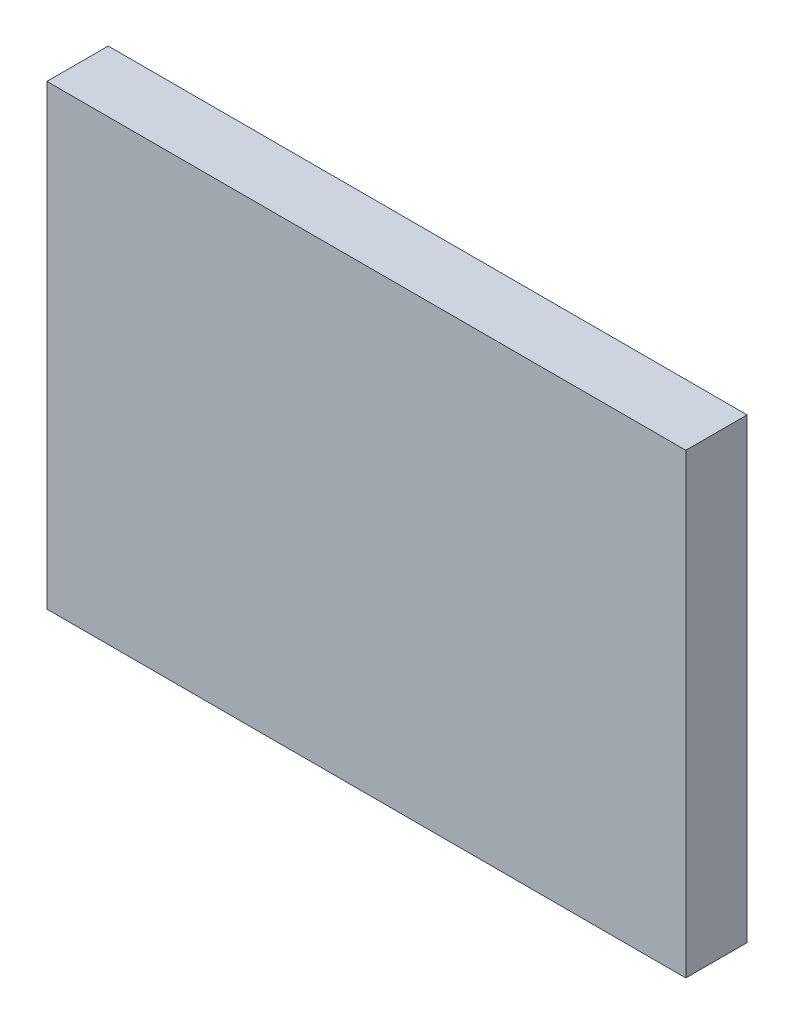
ISO-10303-21;
HEADER;
FILE_DESCRIPTION(('STEP AP214'),'2;1');
FILE_NAME('part.step','',(''),(''),'','','');
FILE_SCHEMA(('AUTOMOTIVE_DESIGN { 1 0 10303 214 1 1 1 1 }'));
ENDSEC;
DATA;
#1=APPLICATION_CONTEXT('core data for automotive mechanical design processes');
#2=APPLICATION_PROTOCOL_DEFINITION('international standard','automotive_design',2000,#1);
#3=PRODUCT_CONTEXT('',#1,'mechanical');
#4=PRODUCT('Part','Part','',(#3));
#5=PRODUCT_RELATED_PRODUCT_CATEGORY('part','',(#4));
#6=PRODUCT_DEFINITION_FORMATION('','',#4);
#7=PRODUCT_DEFINITION_CONTEXT('part definition',#1,'design');
#8=PRODUCT_DEFINITION('design','',#6,#7);
#9=PRODUCT_DEFINITION_SHAPE('','',#8);
#10=(LENGTH_UNIT() NAMED_UNIT(*) SI_UNIT(.MILLI.,.METRE.));
#11=(NAMED_UNIT(*) PLANE_ANGLE_UNIT() SI_UNIT($,.RADIAN.));
#12=(NAMED_UNIT(*) SI_UNIT($,.STERADIAN.) SOLID_ANGLE_UNIT());
#13=UNCERTAINTY_MEASURE_WITH_UNIT(LENGTH_MEASURE(1.E-05),#10,'distance_accuracy_value','');
#14=(GEOMETRIC_REPRESENTATION_CONTEXT(3) GLOBAL_UNCERTAINTY_ASSIGNED_CONTEXT((#13)) GLOBAL_UNIT_ASSIGNED_CONTEXT((#10,
#11,#12)) REPRESENTATION_CONTEXT('',''));
#15=CARTESIAN_POINT('',(0.,0.,0.));
#16=DIRECTION('',(0.,0.,1.));
#17=DIRECTION('',(1.,0.,0.));
#18=AXIS2_PLACEMENT_3D('',#15,#16,#17);
#19=CARTESIAN_POINT('',(0.49250811985747,-0.604008281971269,0.));
#20=DIRECTION('',(-1.,0.,0.));
#21=DIRECTION('',(0.,-1.,0.));
#22=AXIS2_PLACEMENT_3D('',#19,#20,#21);
#23=PLANE('',#22);
#24=DIRECTION('',(0.,-1.,0.));
#25=VECTOR('',#24,1.);
#26=CARTESIAN_POINT('',(0.49250811985747,-0.604008281971269,0.));
#27=LINE('',#26,#25);
#28=CARTESIAN_POINT('',(0.49250811985747,-0.604008281971269,0.));
#29=VERTEX_POINT('',#28);
#30=CARTESIAN_POINT('',(0.49250811985747,-0.626373786984169,0.));
#31=VERTEX_POINT('',#30);
#32=EDGE_CURVE('E11',#29,#31,#27,.T.);
#33=ORIENTED_EDGE('',*,*,#32,.T.);
#34=DIRECTION('',(0.,0.,1.));
#35=VECTOR('',#34,1.);
#36=CARTESIAN_POINT('',(0.49250811985747,-0.626373786984169,0.));
#37=LINE('',#36,#35);
#38=CARTESIAN_POINT('',(0.49250811985747,-0.626373786984169,0.003));
#39=VERTEX_POINT('',#38);
#40=EDGE_CURVE('E24',#31,#39,#37,.T.);
#41=ORIENTED_EDGE('',*,*,#40,.T.);
#42=DIRECTION('',(0.,-1.,0.));
#43=VECTOR('',#42,1.);
#44=CARTESIAN_POINT('',(0.49250811985747,-0.604008281971269,0.003));
#45=LINE('',#44,#43);
#46=CARTESIAN_POINT('',(0.49250811985747,-0.604008281971269,0.003));
#47=VERTEX_POINT('',#46);
#48=EDGE_CURVE('E75',#47,#39,#45,.T.);
#49=ORIENTED_EDGE('',*,*,#48,.F.);
#50=DIRECTION('',(0.,0.,1.));
#51=VECTOR('',#50,1.);
#52=CARTESIAN_POINT('',(0.49250811985747,-0.604008281971269,0.));
#53=LINE('',#52,#51);
#54=EDGE_CURVE('E86',#29,#47,#53,.T.);
#55=ORIENTED_EDGE('',*,*,#54,.F.);
#56=EDGE_LOOP('',(#33,#41,#49,#55));
#57=FACE_BOUND('',#56,.T.);
#58=ADVANCED_FACE('F17',(#57),#23,.T.);
#59=CARTESIAN_POINT('',(0.52377418298775,-0.604008281971269,0.));
#60=DIRECTION('',(0.,1.,0.));
#61=DIRECTION('',(-1.,0.,0.));
#62=AXIS2_PLACEMENT_3D('',#59,#60,#61);
#63=PLANE('',#62);
#64=DIRECTION('',(-1.,0.,0.));
#65=VECTOR('',#64,1.);
#66=CARTESIAN_POINT('',(0.52377418298775,-0.604008281971269,0.));
#67=LINE('',#66,#65);
#68=CARTESIAN_POINT('',(0.52377418298775,-0.604008281971269,0.));
#69=VERTEX_POINT('',#68);
#70=EDGE_CURVE('E83',#69,#29,#67,.T.);
#71=ORIENTED_EDGE('',*,*,#70,.T.);
#72=ORIENTED_EDGE('',*,*,#54,.T.);
#73=DIRECTION('',(-1.,0.,0.));
#74=VECTOR('',#73,1.);
#75=CARTESIAN_POINT('',(0.52377418298775,-0.604008281971269,0.003));
#76=LINE('',#75,#74);
#77=CARTESIAN_POINT('',(0.52377418298775,-0.604008281971269,0.003));
#78=VERTEX_POINT('',#77);
#79=EDGE_CURVE('E81',#78,#47,#76,.T.);
#80=ORIENTED_EDGE('',*,*,#79,.F.);
#81=DIRECTION('',(0.,0.,1.));
#82=VECTOR('',#81,1.);
#83=CARTESIAN_POINT('',(0.52377418298775,-0.604008281971269,0.));
#84=LINE('',#83,#82);
#85=EDGE_CURVE('E61',#69,#78,#84,.T.);
#86=ORIENTED_EDGE('',*,*,#85,.F.);
#87=EDGE_LOOP('',(#71,#72,#80,#86));
#88=FACE_BOUND('',#87,.T.);
#89=ADVANCED_FACE('F91',(#88),#63,.T.);
#90=CARTESIAN_POINT('',(0.52377418298775,-0.626373786984169,0.));
#91=DIRECTION('',(1.,0.,0.));
#92=DIRECTION('',(0.,1.,0.));
#93=AXIS2_PLACEMENT_3D('',#90,#91,#92);
#94=PLANE('',#93);
#95=DIRECTION('',(0.,1.,0.));
#96=VECTOR('',#95,1.);
#97=CARTESIAN_POINT('',(0.52377418298775,-0.626373786984169,0.));
#98=LINE('',#97,#96);
#99=CARTESIAN_POINT('',(0.52377418298775,-0.626373786984169,0.));
#100=VERTEX_POINT('',#99);
#101=EDGE_CURVE('E65',#100,#69,#98,.T.);
#102=ORIENTED_EDGE('',*,*,#101,.T.);
#103=ORIENTED_EDGE('',*,*,#85,.T.);
#104=DIRECTION('',(0.,1.,0.));
#105=VECTOR('',#104,1.);
#106=CARTESIAN_POINT('',(0.52377418298775,-0.626373786984169,0.003));
#107=LINE('',#106,#105);
#108=CARTESIAN_POINT('',(0.52377418298775,-0.626373786984169,0.003));
#109=VERTEX_POINT('',#108);
#110=EDGE_CURVE('E54',#109,#78,#107,.T.);
#111=ORIENTED_EDGE('',*,*,#110,.F.);
#112=DIRECTION('',(0.,0.,1.));
#113=VECTOR('',#112,1.);
#114=CARTESIAN_POINT('',(0.52377418298775,-0.626373786984169,0.));
#115=LINE('',#114,#113);
#116=EDGE_CURVE('E58',#100,#109,#115,.T.);
#117=ORIENTED_EDGE('',*,*,#116,.F.);
#118=EDGE_LOOP('',(#102,#103,#111,#117));
#119=FACE_BOUND('',#118,.T.);
#120=ADVANCED_FACE('F57',(#119),#94,.T.);
#121=CARTESIAN_POINT('',(0.49250811985747,-0.626373786984169,0.));
#122=DIRECTION('',(0.,-1.,0.));
#123=DIRECTION('',(1.,0.,0.));
#124=AXIS2_PLACEMENT_3D('',#121,#122,#123);
#125=PLANE('',#124);
#126=DIRECTION('',(1.,0.,0.));
#127=VECTOR('',#126,1.);
#128=CARTESIAN_POINT('',(0.49250811985747,-0.626373786984169,0.));
#129=LINE('',#128,#127);
#130=EDGE_CURVE('E71',#31,#100,#129,.T.);
#131=ORIENTED_EDGE('',*,*,#130,.T.);
#132=ORIENTED_EDGE('',*,*,#116,.T.);
#133=DIRECTION('',(1.,0.,0.));
#134=VECTOR('',#133,1.);
#135=CARTESIAN_POINT('',(0.49250811985747,-0.626373786984169,0.003));
#136=LINE('',#135,#134);
#137=EDGE_CURVE('E70',#39,#109,#136,.T.);
#138=ORIENTED_EDGE('',*,*,#137,.F.);
#139=ORIENTED_EDGE('',*,*,#40,.F.);
#140=EDGE_LOOP('',(#131,#132,#138,#139));
#141=FACE_BOUND('',#140,.T.);
#142=ADVANCED_FACE('F69',(#141),#125,.T.);
#143=CARTESIAN_POINT('',(0.50814115142261,-0.615191034477719,0.003));
#144=DIRECTION('',(0.,0.,1.));
#145=DIRECTION('',(1.,0.,0.));
#146=AXIS2_PLACEMENT_3D('',#143,#144,#145);
#147=PLANE('',#146);
#148=ORIENTED_EDGE('',*,*,#137,.T.);
#149=ORIENTED_EDGE('',*,*,#110,.T.);
#150=ORIENTED_EDGE('',*,*,#79,.T.);
#151=ORIENTED_EDGE('',*,*,#48,.T.);
#152=EDGE_LOOP('',(#148,#149,#150,#151));
#153=FACE_BOUND('',#152,.T.);
#154=ADVANCED_FACE('F74',(#153),#147,.T.);
#155=CARTESIAN_POINT('',(0.50814115142261,-0.615191034477719,0.));
#156=DIRECTION('',(0.,0.,1.));
#157=DIRECTION('',(1.,0.,0.));
#158=AXIS2_PLACEMENT_3D('',#155,#156,#157);
#159=PLANE('',#158);
#160=ORIENTED_EDGE('',*,*,#130,.F.);
#161=ORIENTED_EDGE('',*,*,#32,.F.);
#162=ORIENTED_EDGE('',*,*,#70,.F.);
#163=ORIENTED_EDGE('',*,*,#101,.F.);
#164=EDGE_LOOP('',(#160,#161,#162,#163));
#165=FACE_BOUND('',#164,.T.);
#166=ADVANCED_FACE('F89',(#165),#159,.F.);
#167=CLOSED_SHELL('',(#58,#89,#120,#142,#154,#166));
#168=MANIFOLD_SOLID_BREP('B1',#167);
#169=ADVANCED_BREP_SHAPE_REPRESENTATION('',(#18,#168),#14);
#170=SHAPE_DEFINITION_REPRESENTATION(#9,#169);
ENDSEC;
END-ISO-10303-21;
